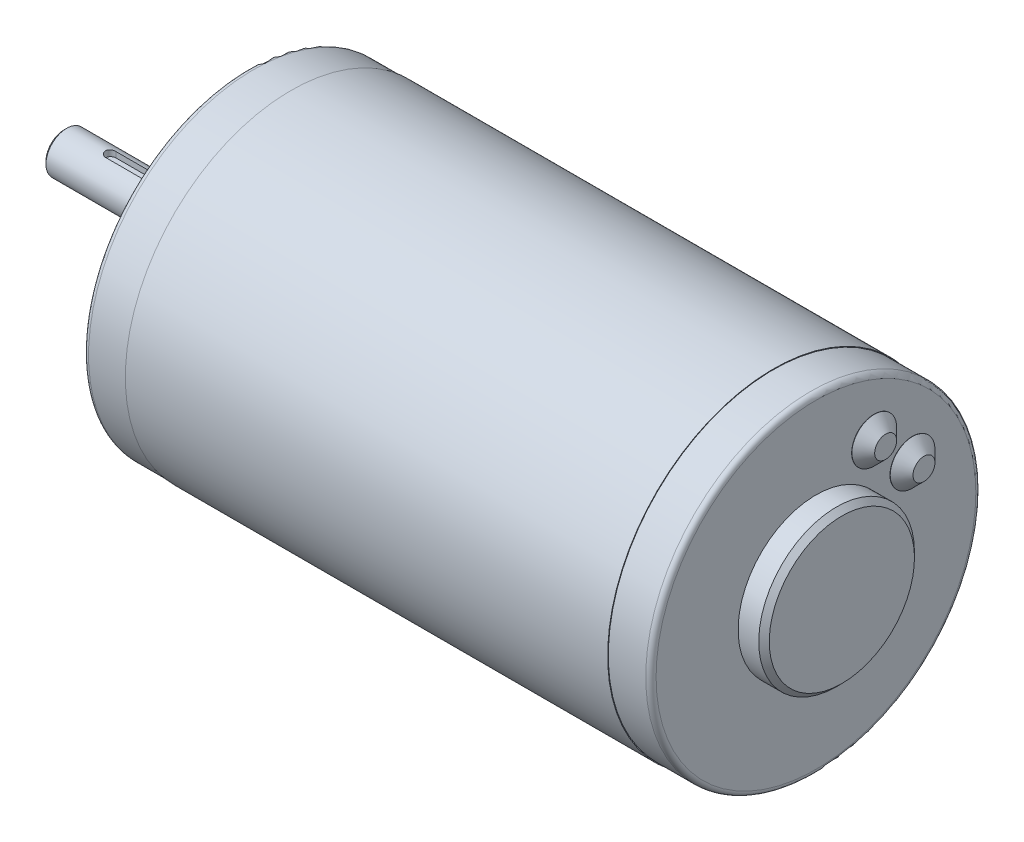
ISO-10303-21;
HEADER;
FILE_DESCRIPTION(('STEP AP214'),'2;1');
FILE_NAME('part.step','',(''),(''),'','','');
FILE_SCHEMA(('AUTOMOTIVE_DESIGN { 1 0 10303 214 1 1 1 1 }'));
ENDSEC;
DATA;
#1=APPLICATION_CONTEXT('core data for automotive mechanical design processes');
#2=APPLICATION_PROTOCOL_DEFINITION('international standard','automotive_design',2000,#1);
#3=PRODUCT_CONTEXT('',#1,'mechanical');
#4=PRODUCT('Part','Part','',(#3));
#5=PRODUCT_RELATED_PRODUCT_CATEGORY('part','',(#4));
#6=PRODUCT_DEFINITION_FORMATION('','',#4);
#7=PRODUCT_DEFINITION_CONTEXT('part definition',#1,'design');
#8=PRODUCT_DEFINITION('design','',#6,#7);
#9=PRODUCT_DEFINITION_SHAPE('','',#8);
#10=(LENGTH_UNIT() NAMED_UNIT(*) SI_UNIT(.MILLI.,.METRE.));
#11=(NAMED_UNIT(*) PLANE_ANGLE_UNIT() SI_UNIT($,.RADIAN.));
#12=(NAMED_UNIT(*) SI_UNIT($,.STERADIAN.) SOLID_ANGLE_UNIT());
#13=UNCERTAINTY_MEASURE_WITH_UNIT(LENGTH_MEASURE(1.E-05),#10,'distance_accuracy_value','');
#14=(GEOMETRIC_REPRESENTATION_CONTEXT(3) GLOBAL_UNCERTAINTY_ASSIGNED_CONTEXT((#13)) GLOBAL_UNIT_ASSIGNED_CONTEXT((#10,
#11,#12)) REPRESENTATION_CONTEXT('',''));
#15=CARTESIAN_POINT('',(0.,0.,0.));
#16=DIRECTION('',(0.,0.,1.));
#17=DIRECTION('',(1.,0.,0.));
#18=AXIS2_PLACEMENT_3D('',#15,#16,#17);
#19=CARTESIAN_POINT('',(-27.6,2.79999999999999,-1.));
#20=DIRECTION('',(0.,-1.,0.));
#21=DIRECTION('',(0.,0.,-1.));
#22=AXIS2_PLACEMENT_3D('',#19,#20,#21);
#23=PLANE('',#22);
#24=CARTESIAN_POINT('',(-7.1,2.79999999999999,0.));
#25=DIRECTION('',(0.,1.,0.));
#26=DIRECTION('',(0.,0.,1.));
#27=AXIS2_PLACEMENT_3D('',#24,#25,#26);
#28=CIRCLE('',#27,1.);
#29=CARTESIAN_POINT('',(-7.1,2.79999999999999,1.));
#30=VERTEX_POINT('',#29);
#31=CARTESIAN_POINT('',(-7.1,2.79999999999999,-1.));
#32=VERTEX_POINT('',#31);
#33=EDGE_CURVE('E88',#30,#32,#28,.T.);
#34=ORIENTED_EDGE('',*,*,#33,.T.);
#35=DIRECTION('',(1.,0.,0.));
#36=VECTOR('',#35,1.);
#37=CARTESIAN_POINT('',(-27.6,2.79999999999999,-1.));
#38=LINE('',#37,#36);
#39=CARTESIAN_POINT('',(-26.6,2.79999999999999,-1.));
#40=VERTEX_POINT('',#39);
#41=EDGE_CURVE('E83',#40,#32,#38,.T.);
#42=ORIENTED_EDGE('',*,*,#41,.F.);
#43=CARTESIAN_POINT('',(-26.6,2.79999999999999,0.));
#44=DIRECTION('',(0.,-1.,0.));
#45=DIRECTION('',(0.,0.,-1.));
#46=AXIS2_PLACEMENT_3D('',#43,#44,#45);
#47=CIRCLE('',#46,1.);
#48=CARTESIAN_POINT('',(-26.6,2.79999999999999,1.));
#49=VERTEX_POINT('',#48);
#50=EDGE_CURVE('E85',#40,#49,#47,.F.);
#51=ORIENTED_EDGE('',*,*,#50,.T.);
#52=DIRECTION('',(1.,0.,0.));
#53=VECTOR('',#52,1.);
#54=CARTESIAN_POINT('',(-27.6,2.79999999999999,1.));
#55=LINE('',#54,#53);
#56=EDGE_CURVE('E111',#49,#30,#55,.T.);
#57=ORIENTED_EDGE('',*,*,#56,.T.);
#58=EDGE_LOOP('',(#34,#42,#51,#57));
#59=FACE_BOUND('',#58,.T.);
#60=ADVANCED_FACE('F25',(#59),#23,.F.);
#61=CARTESIAN_POINT('',(-35.6,0.,0.));
#62=DIRECTION('',(-1.,0.,0.));
#63=DIRECTION('',(0.,0.,1.));
#64=AXIS2_PLACEMENT_3D('',#61,#62,#63);
#65=PLANE('',#64);
#66=CARTESIAN_POINT('',(-35.6000000000449,0.,0.));
#67=DIRECTION('',(1.,0.,0.));
#68=DIRECTION('',(0.,0.,-1.));
#69=AXIS2_PLACEMENT_3D('',#66,#67,#68);
#70=CIRCLE('',#69,3.49999999997408);
#71=CARTESIAN_POINT('',(-35.6000000000449,0.,-3.49999999997408));
#72=VERTEX_POINT('',#71);
#73=EDGE_CURVE('E333',#72,#72,#70,.T.);
#74=ORIENTED_EDGE('',*,*,#73,.F.);
#75=EDGE_LOOP('',(#74));
#76=FACE_BOUND('',#75,.T.);
#77=ADVANCED_FACE('F671',(#76),#65,.T.);
#78=CARTESIAN_POINT('',(-26.6,3.87298334620741,0.));
#79=DIRECTION('',(0.,-1.,0.));
#80=DIRECTION('',(0.,0.,-1.));
#81=AXIS2_PLACEMENT_3D('',#78,#79,#80);
#82=CYLINDRICAL_SURFACE('',#81,1.);
#83=CARTESIAN_POINT('',(-26.6,3.87298334620741,1.));
#84=CARTESIAN_POINT('',(-26.6276629851065,3.87298148580177,1.00000033749611));
#85=CARTESIAN_POINT('',(-26.6553122630182,3.8732800994947,0.998851407375366));
#86=CARTESIAN_POINT('',(-26.7104040353036,3.87445904774558,0.994271295395754));
#87=CARTESIAN_POINT('',(-26.7378465636871,3.87533928441687,0.99084049757268));
#88=CARTESIAN_POINT('',(-26.8194531732088,3.87881710972053,0.977175239382527));
#89=CARTESIAN_POINT('',(-26.8730564684822,3.88225203148808,0.963567695172493));
#90=CARTESIAN_POINT('',(-26.977124673782,3.89095422588002,0.927798076247996));
#91=CARTESIAN_POINT('',(-27.0275898782129,3.89622132630929,0.905636805423835));
#92=CARTESIAN_POINT('',(-27.1241114486473,3.90799134471939,0.853415378025865));
#93=CARTESIAN_POINT('',(-27.170166627891,3.91449459395647,0.823353103356933));
#94=CARTESIAN_POINT('',(-27.2575438819061,3.92816262398025,0.755484471828068));
#95=CARTESIAN_POINT('',(-27.2987548862455,3.93533791028915,0.717537268783974));
#96=CARTESIAN_POINT('',(-27.3743020894827,3.94945104396193,0.635275780516228));
#97=CARTESIAN_POINT('',(-27.4086371894679,3.95638885322537,0.590960479478829));
#98=CARTESIAN_POINT('',(-27.4699110016186,3.96936182283248,0.496456899401689));
#99=CARTESIAN_POINT('',(-27.496739895984,3.9753830468173,0.446195340334472));
#100=CARTESIAN_POINT('',(-27.5415247341967,3.98572346250588,0.341702590842916));
#101=CARTESIAN_POINT('',(-27.5594824242998,3.990042989147,0.287472184083007));
#102=CARTESIAN_POINT('',(-27.5856589927774,3.99641900005128,0.177744108525158));
#103=CARTESIAN_POINT('',(-27.5940676724228,3.998519529013,0.122294322002856));
#104=CARTESIAN_POINT('',(-27.6015033715433,4.00037438150815,0.0107327756816783));
#105=CARTESIAN_POINT('',(-27.6005315701923,4.00012899993444,-0.0453789000287066));
#106=CARTESIAN_POINT('',(-27.5893700363145,3.99735237365735,-0.155352492972097));
#107=CARTESIAN_POINT('',(-27.5793853834005,3.9948719867736,-0.209236701739855));
#108=CARTESIAN_POINT('',(-27.5508113208172,3.98796330636495,-0.31453871108434));
#109=CARTESIAN_POINT('',(-27.5322215304314,3.98353492665556,-0.365956402423988));
#110=CARTESIAN_POINT('',(-27.4867987193293,3.97314997761798,-0.46540728602454));
#111=CARTESIAN_POINT('',(-27.4598926057672,3.96717993827555,-0.513405629602248));
#112=CARTESIAN_POINT('',(-27.3986568701665,3.95435945541919,-0.604276631230015));
#113=CARTESIAN_POINT('',(-27.3643261297468,3.94750887933198,-0.64714851556229));
#114=CARTESIAN_POINT('',(-27.2881210879187,3.93345566022865,-0.727769389708492));
#115=CARTESIAN_POINT('',(-27.2460683634602,3.92624850477685,-0.765349103054128));
#116=CARTESIAN_POINT('',(-27.1561701330723,3.91246168284006,-0.832969575186237));
#117=CARTESIAN_POINT('',(-27.1083230467164,3.90588218842993,-0.863008270245062));
#118=CARTESIAN_POINT('',(-27.0078544021762,3.89407813586325,-0.914804709285962));
#119=CARTESIAN_POINT('',(-26.9552085351039,3.88886106009136,-0.936517017887269));
#120=CARTESIAN_POINT('',(-26.8468830715817,3.88047058807055,-0.970702351849828));
#121=CARTESIAN_POINT('',(-26.7912081448502,3.87729413761435,-0.983189189212132));
#122=CARTESIAN_POINT('',(-26.7125426192411,3.87455290681524,-0.993904635150938));
#123=CARTESIAN_POINT('',(-26.6900802967868,3.87396523110859,-0.996190790966708));
#124=CARTESIAN_POINT('',(-26.6450822100907,3.87318062488974,-0.999236757697394));
#125=CARTESIAN_POINT('',(-26.6225466240447,3.87298306219461,-0.999999038096045));
#126=CARTESIAN_POINT('',(-26.6,3.87298334620741,-1.));
#127=B_SPLINE_CURVE_WITH_KNOTS('',3,(#83,#84,#85,#86,#87,#88,#89,#90,#91,#92,#93,#94,#95,#96,
#97,#98,#99,#100,#101,#102,#103,#104,#105,#106,#107,#108,#109,#110,#111,#112,#113,#114,#115,
#116,#117,#118,#119,#120,#121,#122,#123,#124,#125,#126),.UNSPECIFIED.,.F.,.F.,(4,2,2,2,2,2,2,2,
2,2,2,2,2,2,2,2,2,2,2,2,2,4),(0.,0.0829365303397693,0.16585910608465,0.331229963080318,
0.496585282091499,0.661984974726751,0.830641897427977,0.999325753539196,1.17036187098235,
1.34136430732425,1.50890481515325,1.67642426256639,1.84022545479276,2.00403389475838,
2.16932509450376,2.33464120964329,2.50441429534542,2.67423379180967,2.84496720161068,
3.01544447539986,3.08315848722648,3.15076267731671),.UNSPECIFIED.);
#128=CARTESIAN_POINT('',(-26.6,3.87298334620741,1.));
#129=VERTEX_POINT('',#128);
#130=CARTESIAN_POINT('',(-26.6,3.87298334620741,-1.));
#131=VERTEX_POINT('',#130);
#132=EDGE_CURVE('E169',#129,#131,#127,.T.);
#133=ORIENTED_EDGE('',*,*,#132,.F.);
#134=DIRECTION('',(0.,1.,0.));
#135=VECTOR('',#134,1.);
#136=CARTESIAN_POINT('',(-26.6,2.79999999999999,1.));
#137=LINE('',#136,#135);
#138=EDGE_CURVE('E98',#129,#49,#137,.F.);
#139=ORIENTED_EDGE('',*,*,#138,.T.);
#140=ORIENTED_EDGE('',*,*,#50,.F.);
#141=DIRECTION('',(0.,1.,0.));
#142=VECTOR('',#141,1.);
#143=CARTESIAN_POINT('',(-26.6,2.79999999999999,-1.));
#144=LINE('',#143,#142);
#145=EDGE_CURVE('E92',#131,#40,#144,.F.);
#146=ORIENTED_EDGE('',*,*,#145,.F.);
#147=EDGE_LOOP('',(#133,#139,#140,#146));
#148=FACE_BOUND('',#147,.T.);
#149=ADVANCED_FACE('F95',(#148),#82,.F.);
#150=CARTESIAN_POINT('',(-27.6,2.79999999999999,-1.));
#151=DIRECTION('',(0.,0.,1.));
#152=DIRECTION('',(1.,0.,0.));
#153=AXIS2_PLACEMENT_3D('',#150,#151,#152);
#154=PLANE('',#153);
#155=DIRECTION('',(1.,0.,0.));
#156=VECTOR('',#155,1.);
#157=CARTESIAN_POINT('',(0.,3.87298334620741,-1.));
#158=LINE('',#157,#156);
#159=CARTESIAN_POINT('',(-7.1,3.87298334620741,-1.));
#160=VERTEX_POINT('',#159);
#161=EDGE_CURVE('E103',#131,#160,#158,.T.);
#162=ORIENTED_EDGE('',*,*,#161,.F.);
#163=ORIENTED_EDGE('',*,*,#145,.T.);
#164=ORIENTED_EDGE('',*,*,#41,.T.);
#165=DIRECTION('',(0.,1.,0.));
#166=VECTOR('',#165,1.);
#167=CARTESIAN_POINT('',(-7.1,2.79999999999999,-1.));
#168=LINE('',#167,#166);
#169=EDGE_CURVE('E106',#32,#160,#168,.T.);
#170=ORIENTED_EDGE('',*,*,#169,.T.);
#171=EDGE_LOOP('',(#162,#163,#164,#170));
#172=FACE_BOUND('',#171,.T.);
#173=ADVANCED_FACE('F101',(#172),#154,.T.);
#174=CARTESIAN_POINT('',(-7.1,2.79999999999999,0.));
#175=DIRECTION('',(0.,1.,0.));
#176=DIRECTION('',(0.,0.,1.));
#177=AXIS2_PLACEMENT_3D('',#174,#175,#176);
#178=CYLINDRICAL_SURFACE('',#177,1.);
#179=ORIENTED_EDGE('',*,*,#33,.F.);
#180=DIRECTION('',(0.,1.,0.));
#181=VECTOR('',#180,1.);
#182=CARTESIAN_POINT('',(-7.1,2.79999999999999,1.));
#183=LINE('',#182,#181);
#184=CARTESIAN_POINT('',(-7.1,3.87298334620741,1.));
#185=VERTEX_POINT('',#184);
#186=EDGE_CURVE('E112',#30,#185,#183,.T.);
#187=ORIENTED_EDGE('',*,*,#186,.T.);
#188=CARTESIAN_POINT('',(-7.1,3.87298334620741,-1.));
#189=CARTESIAN_POINT('',(-7.07233701489346,3.87298148580177,-1.00000033749611));
#190=CARTESIAN_POINT('',(-7.04468773698177,3.8732800994947,-0.998851407375366));
#191=CARTESIAN_POINT('',(-6.98959596469644,3.87445904774558,-0.994271295395754));
#192=CARTESIAN_POINT('',(-6.96215343631291,3.87533928441687,-0.990840497572679));
#193=CARTESIAN_POINT('',(-6.88054682679116,3.87881710972053,-0.977175239382527));
#194=CARTESIAN_POINT('',(-6.82694353151779,3.88225203148808,-0.963567695172494));
#195=CARTESIAN_POINT('',(-6.72287532621804,3.89095422588002,-0.927798076247997));
#196=CARTESIAN_POINT('',(-6.67241012178715,3.89622132630929,-0.905636805423836));
#197=CARTESIAN_POINT('',(-6.57588855135267,3.90799134471939,-0.853415378025865));
#198=CARTESIAN_POINT('',(-6.52983337210904,3.91449459395647,-0.823353103356933));
#199=CARTESIAN_POINT('',(-6.4424561180939,3.92816262398025,-0.755484471828069));
#200=CARTESIAN_POINT('',(-6.40124511375448,3.93533791028915,-0.717537268783976));
#201=CARTESIAN_POINT('',(-6.3256979105173,3.94945104396193,-0.63527578051623));
#202=CARTESIAN_POINT('',(-6.29136281053206,3.95638885322537,-0.590960479478831));
#203=CARTESIAN_POINT('',(-6.23008899838136,3.96936182283248,-0.496456899401691));
#204=CARTESIAN_POINT('',(-6.20326010401603,3.9753830468173,-0.446195340334474));
#205=CARTESIAN_POINT('',(-6.1584752658033,3.98572346250588,-0.341702590842919));
#206=CARTESIAN_POINT('',(-6.14051757570017,3.990042989147,-0.28747218408301));
#207=CARTESIAN_POINT('',(-6.11434100722257,3.99641900005128,-0.17774410852516));
#208=CARTESIAN_POINT('',(-6.10593232757718,3.998519529013,-0.122294322002858));
#209=CARTESIAN_POINT('',(-6.09849662845671,4.00037438150815,-0.0107327756816796));
#210=CARTESIAN_POINT('',(-6.09946842980766,4.00012899993444,0.0453789000287056));
#211=CARTESIAN_POINT('',(-6.11062996368545,3.99735237365735,0.155352492972096));
#212=CARTESIAN_POINT('',(-6.12061461659948,3.9948719867736,0.209236701739855));
#213=CARTESIAN_POINT('',(-6.14918867918275,3.98796330636495,0.31453871108434));
#214=CARTESIAN_POINT('',(-6.16777846956858,3.98353492665556,0.365956402423988));
#215=CARTESIAN_POINT('',(-6.21320128067065,3.97314997761798,0.465407286024539));
#216=CARTESIAN_POINT('',(-6.24010739423284,3.96717993827555,0.513405629602249));
#217=CARTESIAN_POINT('',(-6.30134312983347,3.95435945541919,0.604276631230014));
#218=CARTESIAN_POINT('',(-6.33567387025322,3.94750887933198,0.647148515562289));
#219=CARTESIAN_POINT('',(-6.41187891208131,3.93345566022865,0.72776938970849));
#220=CARTESIAN_POINT('',(-6.45393163653982,3.92624850477685,0.765349103054127));
#221=CARTESIAN_POINT('',(-6.54382986692774,3.91246168284006,0.832969575186237));
#222=CARTESIAN_POINT('',(-6.59167695328356,3.90588218842993,0.863008270245062));
#223=CARTESIAN_POINT('',(-6.69214559782377,3.89407813586325,0.914804709285962));
#224=CARTESIAN_POINT('',(-6.74479146489609,3.88886106009136,0.936517017887269));
#225=CARTESIAN_POINT('',(-6.85311692841829,3.88047058807055,0.970702351849828));
#226=CARTESIAN_POINT('',(-6.90879185514984,3.87729413761435,0.983189189212131));
#227=CARTESIAN_POINT('',(-6.98745738075891,3.87455290681524,0.993904635150938));
#228=CARTESIAN_POINT('',(-7.00991970321318,3.87396523110859,0.996190790966708));
#229=CARTESIAN_POINT('',(-7.05491778990932,3.87318062488974,0.999236757697394));
#230=CARTESIAN_POINT('',(-7.07745337595529,3.8729830621946,0.999999038096045));
#231=CARTESIAN_POINT('',(-7.1,3.87298334620741,1.));
#232=B_SPLINE_CURVE_WITH_KNOTS('',3,(#188,#189,#190,#191,#192,#193,#194,#195,#196,#197,#198,
#199,#200,#201,#202,#203,#204,#205,#206,#207,#208,#209,#210,#211,#212,#213,#214,#215,#216,#217,
#218,#219,#220,#221,#222,#223,#224,#225,#226,#227,#228,#229,#230,#231),.UNSPECIFIED.,.F.,.F.,(4,
2,2,2,2,2,2,2,2,2,2,2,2,2,2,2,2,2,2,2,2,4),(0.,0.0829365303397684,0.165859106084651,
0.331229963080317,0.496585282091498,0.661984974726749,0.830641897427974,0.999325753539193,
1.17036187098235,1.34136430732424,1.50890481515325,1.67642426256639,1.84022545479276,
2.00403389475838,2.16932509450376,2.33464120964329,2.50441429534542,2.67423379180967,
2.84496720161068,3.01544447539986,3.08315848722648,3.15076267731671),.UNSPECIFIED.);
#233=EDGE_CURVE('E160',#160,#185,#232,.T.);
#234=ORIENTED_EDGE('',*,*,#233,.F.);
#235=ORIENTED_EDGE('',*,*,#169,.F.);
#236=EDGE_LOOP('',(#179,#187,#234,#235));
#237=FACE_BOUND('',#236,.T.);
#238=ADVANCED_FACE('F175',(#237),#178,.F.);
#239=CARTESIAN_POINT('',(-27.6,2.79999999999999,1.));
#240=DIRECTION('',(0.,0.,1.));
#241=DIRECTION('',(1.,0.,0.));
#242=AXIS2_PLACEMENT_3D('',#239,#240,#241);
#243=PLANE('',#242);
#244=ORIENTED_EDGE('',*,*,#186,.F.);
#245=ORIENTED_EDGE('',*,*,#56,.F.);
#246=ORIENTED_EDGE('',*,*,#138,.F.);
#247=DIRECTION('',(1.,0.,0.));
#248=VECTOR('',#247,1.);
#249=CARTESIAN_POINT('',(0.,3.87298334620741,1.));
#250=LINE('',#249,#248);
#251=EDGE_CURVE('E168',#185,#129,#250,.F.);
#252=ORIENTED_EDGE('',*,*,#251,.F.);
#253=EDGE_LOOP('',(#244,#245,#246,#252));
#254=FACE_BOUND('',#253,.T.);
#255=ADVANCED_FACE('F190',(#254),#243,.F.);
#256=CARTESIAN_POINT('',(-35.0999999999999,0.,0.));
#257=DIRECTION('',(1.,0.,0.));
#258=DIRECTION('',(0.,0.,-1.));
#259=AXIS2_PLACEMENT_3D('',#256,#257,#258);
#260=CONICAL_SURFACE('',#259,3.99999999996226,0.785398163340605);
#261=ORIENTED_EDGE('',*,*,#73,.T.);
#262=EDGE_LOOP('',(#261));
#263=FACE_BOUND('',#262,.T.);
#264=CARTESIAN_POINT('',(-35.1,0.,0.));
#265=DIRECTION('',(1.,0.,0.));
#266=DIRECTION('',(0.,0.,-1.));
#267=AXIS2_PLACEMENT_3D('',#264,#265,#266);
#268=CIRCLE('',#267,4.);
#269=CARTESIAN_POINT('',(-35.1,0.,-4.));
#270=VERTEX_POINT('',#269);
#271=EDGE_CURVE('E159',#270,#270,#268,.T.);
#272=ORIENTED_EDGE('',*,*,#271,.F.);
#273=EDGE_LOOP('',(#272));
#274=FACE_BOUND('',#273,.T.);
#275=ADVANCED_FACE('F185',(#263,#274),#260,.T.);
#276=CARTESIAN_POINT('',(0.,0.,0.));
#277=DIRECTION('',(1.,0.,0.));
#278=DIRECTION('',(0.,0.,-1.));
#279=AXIS2_PLACEMENT_3D('',#276,#277,#278);
#280=CYLINDRICAL_SURFACE('',#279,4.);
#281=ORIENTED_EDGE('',*,*,#271,.T.);
#282=EDGE_LOOP('',(#281));
#283=FACE_BOUND('',#282,.T.);
#284=CARTESIAN_POINT('',(-4.,0.,0.));
#285=DIRECTION('',(1.,0.,0.));
#286=DIRECTION('',(0.,0.,-1.));
#287=AXIS2_PLACEMENT_3D('',#284,#285,#286);
#288=CIRCLE('',#287,4.);
#289=CARTESIAN_POINT('',(-4.,0.,-4.));
#290=VERTEX_POINT('',#289);
#291=EDGE_CURVE('E156',#290,#290,#288,.T.);
#292=ORIENTED_EDGE('',*,*,#291,.F.);
#293=EDGE_LOOP('',(#292));
#294=FACE_BOUND('',#293,.T.);
#295=ORIENTED_EDGE('',*,*,#233,.T.);
#296=ORIENTED_EDGE('',*,*,#251,.T.);
#297=ORIENTED_EDGE('',*,*,#132,.T.);
#298=ORIENTED_EDGE('',*,*,#161,.T.);
#299=EDGE_LOOP('',(#295,#296,#297,#298));
#300=FACE_BOUND('',#299,.T.);
#301=ADVANCED_FACE('F179',(#283,#294,#300),#280,.T.);
#302=CARTESIAN_POINT('',(-4.,4.,0.));
#303=DIRECTION('',(-1.,0.,0.));
#304=DIRECTION('',(0.,0.,1.));
#305=AXIS2_PLACEMENT_3D('',#302,#303,#304);
#306=PLANE('',#305);
#307=ORIENTED_EDGE('',*,*,#291,.T.);
#308=EDGE_LOOP('',(#307));
#309=FACE_BOUND('',#308,.T.);
#310=CARTESIAN_POINT('',(-4.,0.,0.));
#311=DIRECTION('',(1.,0.,0.));
#312=DIRECTION('',(0.,1.,0.));
#313=AXIS2_PLACEMENT_3D('',#310,#311,#312);
#314=CIRCLE('',#313,8.509);
#315=CARTESIAN_POINT('',(-4.,8.509,0.));
#316=VERTEX_POINT('',#315);
#317=EDGE_CURVE('E153',#316,#316,#314,.T.);
#318=ORIENTED_EDGE('',*,*,#317,.F.);
#319=EDGE_LOOP('',(#318));
#320=FACE_BOUND('',#319,.T.);
#321=ADVANCED_FACE('F184',(#309,#320),#306,.T.);
#322=CARTESIAN_POINT('',(111.8479,18.6070906828553,-11.2073596390943));
#323=DIRECTION('',(1.,0.,0.));
#324=DIRECTION('',(0.,0.,-1.));
#325=AXIS2_PLACEMENT_3D('',#322,#323,#324);
#326=PLANE('',#325);
#327=CARTESIAN_POINT('',(111.84789999993,18.6070906828553,-11.2073596390943));
#328=DIRECTION('',(-1.,0.,0.));
#329=DIRECTION('',(0.,-1.,0.));
#330=AXIS2_PLACEMENT_3D('',#327,#328,#329);
#331=CIRCLE('',#330,2.11800000003146);
#332=CARTESIAN_POINT('',(111.84789999993,16.4890906828238,-11.2073596390943));
#333=VERTEX_POINT('',#332);
#334=EDGE_CURVE('E150',#333,#333,#331,.T.);
#335=ORIENTED_EDGE('',*,*,#334,.F.);
#336=EDGE_LOOP('',(#335));
#337=FACE_BOUND('',#336,.T.);
#338=ADVANCED_FACE('F474',(#337),#326,.T.);
#339=CARTESIAN_POINT('',(114.6,15.0368,0.));
#340=DIRECTION('',(1.,0.,0.));
#341=DIRECTION('',(0.,0.,-1.));
#342=AXIS2_PLACEMENT_3D('',#339,#340,#341);
#343=PLANE('',#342);
#344=CARTESIAN_POINT('',(114.6,0.,0.));
#345=DIRECTION('',(-1.,0.,0.));
#346=DIRECTION('',(0.,-1.,0.));
#347=AXIS2_PLACEMENT_3D('',#344,#345,#346);
#348=CIRCLE('',#347,14.0208);
#349=CARTESIAN_POINT('',(114.6,-14.0208,0.));
#350=VERTEX_POINT('',#349);
#351=EDGE_CURVE('E147',#350,#350,#348,.T.);
#352=ORIENTED_EDGE('',*,*,#351,.F.);
#353=EDGE_LOOP('',(#352));
#354=FACE_BOUND('',#353,.T.);
#355=ADVANCED_FACE('F464',(#354),#343,.T.);
#356=CARTESIAN_POINT('',(111.8479,11.2073596390943,-18.6070906828553));
#357=DIRECTION('',(1.,0.,0.));
#358=DIRECTION('',(0.,0.,-1.));
#359=AXIS2_PLACEMENT_3D('',#356,#357,#358);
#360=PLANE('',#359);
#361=CARTESIAN_POINT('',(111.84789999993,11.2073596390943,-18.6070906828553));
#362=DIRECTION('',(-1.,0.,0.));
#363=DIRECTION('',(0.,0.,1.));
#364=AXIS2_PLACEMENT_3D('',#361,#362,#363);
#365=CIRCLE('',#364,2.1180000000021);
#366=CARTESIAN_POINT('',(111.84789999993,11.2073596390943,-16.4890906828532));
#367=VERTEX_POINT('',#366);
#368=EDGE_CURVE('E143',#367,#367,#365,.T.);
#369=ORIENTED_EDGE('',*,*,#368,.F.);
#370=EDGE_LOOP('',(#369));
#371=FACE_BOUND('',#370,.T.);
#372=ADVANCED_FACE('F457',(#371),#360,.T.);
#373=CARTESIAN_POINT('',(13.6143999999945,25.4,0.));
#374=DIRECTION('',(-1.,0.,0.));
#375=DIRECTION('',(0.,0.,1.));
#376=AXIS2_PLACEMENT_3D('',#373,#374,#375);
#377=CONICAL_SURFACE('',#376,2.01929999997219,1.02974425867198);
#378=CARTESIAN_POINT('',(14.827717847993,25.4,0.));
#379=VERTEX_POINT('',#378);
#380=VERTEX_LOOP('',#379);
#381=FACE_BOUND('',#380,.T.);
#382=CARTESIAN_POINT('',(13.6144,25.4,0.));
#383=DIRECTION('',(-1.,0.,0.));
#384=DIRECTION('',(0.,0.,1.));
#385=AXIS2_PLACEMENT_3D('',#382,#383,#384);
#386=CIRCLE('',#385,2.0193);
#387=CARTESIAN_POINT('',(13.6144,25.4,2.0193));
#388=VERTEX_POINT('',#387);
#389=EDGE_CURVE('E146',#388,#388,#386,.T.);
#390=ORIENTED_EDGE('',*,*,#389,.T.);
#391=EDGE_LOOP('',(#390));
#392=FACE_BOUND('',#391,.T.);
#393=ADVANCED_FACE('F463',(#381,#392),#377,.F.);
#394=CARTESIAN_POINT('',(13.6143999999945,-25.4,0.));
#395=DIRECTION('',(-1.,0.,0.));
#396=DIRECTION('',(0.,0.,1.));
#397=AXIS2_PLACEMENT_3D('',#394,#395,#396);
#398=CONICAL_SURFACE('',#397,2.01929999997219,1.02974425867198);
#399=CARTESIAN_POINT('',(14.827717847993,-25.4,0.));
#400=VERTEX_POINT('',#399);
#401=VERTEX_LOOP('',#400);
#402=FACE_BOUND('',#401,.T.);
#403=CARTESIAN_POINT('',(13.6144,-25.4,0.));
#404=DIRECTION('',(-1.,0.,0.));
#405=DIRECTION('',(0.,0.,1.));
#406=AXIS2_PLACEMENT_3D('',#403,#404,#405);
#407=CIRCLE('',#406,2.0193);
#408=CARTESIAN_POINT('',(13.6144,-25.4,2.0193));
#409=VERTEX_POINT('',#408);
#410=EDGE_CURVE('E323',#409,#409,#407,.T.);
#411=ORIENTED_EDGE('',*,*,#410,.T.);
#412=EDGE_LOOP('',(#411));
#413=FACE_BOUND('',#412,.T.);
#414=ADVANCED_FACE('F524',(#402,#413),#398,.F.);
#415=CARTESIAN_POINT('',(-2.984,0.,0.));
#416=DIRECTION('',(1.,0.,0.));
#417=DIRECTION('',(0.,1.,0.));
#418=AXIS2_PLACEMENT_3D('',#415,#416,#417);
#419=CONICAL_SURFACE('',#418,9.525,0.78539816339745);
#420=ORIENTED_EDGE('',*,*,#317,.T.);
#421=EDGE_LOOP('',(#420));
#422=FACE_BOUND('',#421,.T.);
#423=CARTESIAN_POINT('',(-2.984,0.,0.));
#424=DIRECTION('',(1.,0.,0.));
#425=DIRECTION('',(0.,0.,-1.));
#426=AXIS2_PLACEMENT_3D('',#423,#424,#425);
#427=CIRCLE('',#426,9.525);
#428=CARTESIAN_POINT('',(-2.984,0.,-9.525));
#429=VERTEX_POINT('',#428);
#430=EDGE_CURVE('E320',#429,#429,#427,.T.);
#431=ORIENTED_EDGE('',*,*,#430,.F.);
#432=EDGE_LOOP('',(#431));
#433=FACE_BOUND('',#432,.T.);
#434=ADVANCED_FACE('F449',(#422,#433),#419,.T.);
#435=CARTESIAN_POINT('',(109.647900000027,18.6070906828553,-11.2073596390943));
#436=DIRECTION('',(-1.,0.,0.));
#437=DIRECTION('',(0.,-1.,0.));
#438=AXIS2_PLACEMENT_3D('',#435,#436,#437);
#439=CONICAL_SURFACE('',#438,4.31799999987712,0.785398163384529);
#440=CARTESIAN_POINT('',(109.6479,18.6070906828553,-11.2073596390943));
#441=DIRECTION('',(-1.,0.,0.));
#442=DIRECTION('',(0.,0.,1.));
#443=AXIS2_PLACEMENT_3D('',#440,#441,#442);
#444=CIRCLE('',#443,4.318);
#445=CARTESIAN_POINT('',(109.6479,18.6070906828553,-6.88935963909434));
#446=VERTEX_POINT('',#445);
#447=EDGE_CURVE('E317',#446,#446,#444,.T.);
#448=ORIENTED_EDGE('',*,*,#447,.F.);
#449=EDGE_LOOP('',(#448));
#450=FACE_BOUND('',#449,.T.);
#451=ORIENTED_EDGE('',*,*,#334,.T.);
#452=EDGE_LOOP('',(#451));
#453=FACE_BOUND('',#452,.T.);
#454=ADVANCED_FACE('F443',(#450,#453),#439,.T.);
#455=CARTESIAN_POINT('',(113.584,0.,0.));
#456=DIRECTION('',(-1.,0.,0.));
#457=DIRECTION('',(0.,-1.,0.));
#458=AXIS2_PLACEMENT_3D('',#455,#456,#457);
#459=CONICAL_SURFACE('',#458,15.0368,0.785398163397441);
#460=ORIENTED_EDGE('',*,*,#351,.T.);
#461=EDGE_LOOP('',(#460));
#462=FACE_BOUND('',#461,.T.);
#463=CARTESIAN_POINT('',(113.584,0.,0.));
#464=DIRECTION('',(1.,0.,0.));
#465=DIRECTION('',(0.,0.,-1.));
#466=AXIS2_PLACEMENT_3D('',#463,#464,#465);
#467=CIRCLE('',#466,15.0368);
#468=CARTESIAN_POINT('',(113.584,0.,-15.0368));
#469=VERTEX_POINT('',#468);
#470=EDGE_CURVE('E314',#469,#469,#467,.F.);
#471=ORIENTED_EDGE('',*,*,#470,.F.);
#472=EDGE_LOOP('',(#471));
#473=FACE_BOUND('',#472,.T.);
#474=ADVANCED_FACE('F433',(#462,#473),#459,.T.);
#475=CARTESIAN_POINT('',(109.647900000084,11.2073596390943,-18.6070906828553));
#476=DIRECTION('',(-1.,0.,0.));
#477=DIRECTION('',(0.,0.,1.));
#478=AXIS2_PLACEMENT_3D('',#475,#476,#477);
#479=CONICAL_SURFACE('',#478,4.31799999990461,0.785398163410367);
#480=CARTESIAN_POINT('',(109.6479,11.2073596390943,-18.6070906828553));
#481=DIRECTION('',(-1.,0.,0.));
#482=DIRECTION('',(0.,0.,1.));
#483=AXIS2_PLACEMENT_3D('',#480,#481,#482);
#484=CIRCLE('',#483,4.318);
#485=CARTESIAN_POINT('',(109.6479,11.2073596390943,-14.2890906828553));
#486=VERTEX_POINT('',#485);
#487=EDGE_CURVE('E142',#486,#486,#484,.T.);
#488=ORIENTED_EDGE('',*,*,#487,.F.);
#489=EDGE_LOOP('',(#488));
#490=FACE_BOUND('',#489,.T.);
#491=ORIENTED_EDGE('',*,*,#368,.T.);
#492=EDGE_LOOP('',(#491));
#493=FACE_BOUND('',#492,.T.);
#494=ADVANCED_FACE('F426',(#490,#493),#479,.T.);
#495=CARTESIAN_POINT('',(0.,25.4,0.));
#496=DIRECTION('',(-1.,0.,0.));
#497=DIRECTION('',(0.,0.,1.));
#498=AXIS2_PLACEMENT_3D('',#495,#496,#497);
#499=CYLINDRICAL_SURFACE('',#498,2.0193);
#500=CARTESIAN_POINT('',(0.,25.4,0.));
#501=DIRECTION('',(-1.,0.,0.));
#502=DIRECTION('',(0.,0.,1.));
#503=AXIS2_PLACEMENT_3D('',#500,#501,#502);
#504=CIRCLE('',#503,2.0193);
#505=CARTESIAN_POINT('',(0.,25.4,2.0193));
#506=VERTEX_POINT('',#505);
#507=EDGE_CURVE('E139',#506,#506,#504,.F.);
#508=ORIENTED_EDGE('',*,*,#507,.F.);
#509=EDGE_LOOP('',(#508));
#510=FACE_BOUND('',#509,.T.);
#511=ORIENTED_EDGE('',*,*,#389,.F.);
#512=EDGE_LOOP('',(#511));
#513=FACE_BOUND('',#512,.T.);
#514=ADVANCED_FACE('F432',(#510,#513),#499,.F.);
#515=CARTESIAN_POINT('',(0.,-25.4,0.));
#516=DIRECTION('',(-1.,0.,0.));
#517=DIRECTION('',(0.,0.,1.));
#518=AXIS2_PLACEMENT_3D('',#515,#516,#517);
#519=CYLINDRICAL_SURFACE('',#518,2.0193);
#520=CARTESIAN_POINT('',(0.,-25.4,0.));
#521=DIRECTION('',(-1.,0.,0.));
#522=DIRECTION('',(0.,0.,1.));
#523=AXIS2_PLACEMENT_3D('',#520,#521,#522);
#524=CIRCLE('',#523,2.0193);
#525=CARTESIAN_POINT('',(0.,-25.4,2.0193));
#526=VERTEX_POINT('',#525);
#527=EDGE_CURVE('E136',#526,#526,#524,.F.);
#528=ORIENTED_EDGE('',*,*,#527,.F.);
#529=EDGE_LOOP('',(#528));
#530=FACE_BOUND('',#529,.T.);
#531=ORIENTED_EDGE('',*,*,#410,.F.);
#532=EDGE_LOOP('',(#531));
#533=FACE_BOUND('',#532,.T.);
#534=ADVANCED_FACE('F549',(#530,#533),#519,.F.);
#535=CARTESIAN_POINT('',(0.,0.,0.));
#536=DIRECTION('',(1.,0.,0.));
#537=DIRECTION('',(0.,0.,-1.));
#538=AXIS2_PLACEMENT_3D('',#535,#536,#537);
#539=CYLINDRICAL_SURFACE('',#538,9.525);
#540=ORIENTED_EDGE('',*,*,#430,.T.);
#541=EDGE_LOOP('',(#540));
#542=FACE_BOUND('',#541,.T.);
#543=CARTESIAN_POINT('',(0.,0.,0.));
#544=DIRECTION('',(1.,0.,0.));
#545=DIRECTION('',(0.,0.,-1.));
#546=AXIS2_PLACEMENT_3D('',#543,#544,#545);
#547=CIRCLE('',#546,9.525);
#548=CARTESIAN_POINT('',(0.,0.,-9.525));
#549=VERTEX_POINT('',#548);
#550=EDGE_CURVE('E133',#549,#549,#547,.T.);
#551=ORIENTED_EDGE('',*,*,#550,.F.);
#552=EDGE_LOOP('',(#551));
#553=FACE_BOUND('',#552,.T.);
#554=ADVANCED_FACE('F418',(#542,#553),#539,.T.);
#555=CARTESIAN_POINT('',(111.8479,18.6070906828553,-11.2073596390943));
#556=DIRECTION('',(-1.,0.,0.));
#557=DIRECTION('',(0.,0.,1.));
#558=AXIS2_PLACEMENT_3D('',#555,#556,#557);
#559=CYLINDRICAL_SURFACE('',#558,4.318);
#560=CARTESIAN_POINT('',(109.6,18.6070906828553,-11.2073596390943));
#561=DIRECTION('',(-1.,0.,0.));
#562=DIRECTION('',(0.,0.,1.));
#563=AXIS2_PLACEMENT_3D('',#560,#561,#562);
#564=CIRCLE('',#563,4.318);
#565=CARTESIAN_POINT('',(109.6,18.6070906828553,-6.88935963909434));
#566=VERTEX_POINT('',#565);
#567=EDGE_CURVE('E130',#566,#566,#564,.T.);
#568=ORIENTED_EDGE('',*,*,#567,.F.);
#569=EDGE_LOOP('',(#568));
#570=FACE_BOUND('',#569,.T.);
#571=ORIENTED_EDGE('',*,*,#447,.T.);
#572=EDGE_LOOP('',(#571));
#573=FACE_BOUND('',#572,.T.);
#574=ADVANCED_FACE('F412',(#570,#573),#559,.T.);
#575=CARTESIAN_POINT('',(0.,0.,0.));
#576=DIRECTION('',(1.,0.,0.));
#577=DIRECTION('',(0.,0.,-1.));
#578=AXIS2_PLACEMENT_3D('',#575,#576,#577);
#579=CYLINDRICAL_SURFACE('',#578,15.0368);
#580=CARTESIAN_POINT('',(109.6,0.,0.));
#581=DIRECTION('',(1.,0.,0.));
#582=DIRECTION('',(0.,0.,-1.));
#583=AXIS2_PLACEMENT_3D('',#580,#581,#582);
#584=CIRCLE('',#583,15.0368);
#585=CARTESIAN_POINT('',(109.6,0.,-15.0368));
#586=VERTEX_POINT('',#585);
#587=EDGE_CURVE('E127',#586,#586,#584,.F.);
#588=ORIENTED_EDGE('',*,*,#587,.F.);
#589=EDGE_LOOP('',(#588));
#590=FACE_BOUND('',#589,.T.);
#591=ORIENTED_EDGE('',*,*,#470,.T.);
#592=EDGE_LOOP('',(#591));
#593=FACE_BOUND('',#592,.T.);
#594=ADVANCED_FACE('F403',(#590,#593),#579,.T.);
#595=CARTESIAN_POINT('',(111.8479,11.2073596390943,-18.6070906828553));
#596=DIRECTION('',(-1.,0.,0.));
#597=DIRECTION('',(0.,0.,1.));
#598=AXIS2_PLACEMENT_3D('',#595,#596,#597);
#599=CYLINDRICAL_SURFACE('',#598,4.318);
#600=CARTESIAN_POINT('',(109.6,11.2073596390943,-18.6070906828553));
#601=DIRECTION('',(-1.,0.,0.));
#602=DIRECTION('',(0.,0.,1.));
#603=AXIS2_PLACEMENT_3D('',#600,#601,#602);
#604=CIRCLE('',#603,4.318);
#605=CARTESIAN_POINT('',(109.6,11.2073596390943,-14.2890906828553));
#606=VERTEX_POINT('',#605);
#607=EDGE_CURVE('E123',#606,#606,#604,.T.);
#608=ORIENTED_EDGE('',*,*,#607,.F.);
#609=EDGE_LOOP('',(#608));
#610=FACE_BOUND('',#609,.T.);
#611=ORIENTED_EDGE('',*,*,#487,.T.);
#612=EDGE_LOOP('',(#611));
#613=FACE_BOUND('',#612,.T.);
#614=ADVANCED_FACE('F397',(#610,#613),#599,.T.);
#615=CARTESIAN_POINT('',(0.,9.525,0.));
#616=DIRECTION('',(-1.,0.,0.));
#617=DIRECTION('',(0.,0.,1.));
#618=AXIS2_PLACEMENT_3D('',#615,#616,#617);
#619=PLANE('',#618);
#620=ORIENTED_EDGE('',*,*,#550,.T.);
#621=EDGE_LOOP('',(#620));
#622=FACE_BOUND('',#621,.T.);
#623=CARTESIAN_POINT('',(0.,0.,0.));
#624=DIRECTION('',(1.,0.,0.));
#625=DIRECTION('',(0.,0.,-1.));
#626=AXIS2_PLACEMENT_3D('',#623,#624,#625);
#627=CIRCLE('',#626,30.877);
#628=CARTESIAN_POINT('',(0.,0.,-30.877));
#629=VERTEX_POINT('',#628);
#630=CARTESIAN_POINT('',(0.,0.,30.877));
#631=VERTEX_POINT('',#630);
#632=EDGE_CURVE('E126',#629,#631,#627,.T.);
#633=ORIENTED_EDGE('',*,*,#632,.F.);
#634=CARTESIAN_POINT('',(0.,0.,0.));
#635=DIRECTION('',(1.,0.,0.));
#636=DIRECTION('',(0.,0.,1.));
#637=AXIS2_PLACEMENT_3D('',#634,#635,#636);
#638=CIRCLE('',#637,30.877);
#639=EDGE_CURVE('E293',#631,#629,#638,.T.);
#640=ORIENTED_EDGE('',*,*,#639,.F.);
#641=EDGE_LOOP('',(#633,#640));
#642=FACE_BOUND('',#641,.T.);
#643=ORIENTED_EDGE('',*,*,#527,.T.);
#644=EDGE_LOOP('',(#643));
#645=FACE_BOUND('',#644,.T.);
#646=ORIENTED_EDGE('',*,*,#507,.T.);
#647=EDGE_LOOP('',(#646));
#648=FACE_BOUND('',#647,.T.);
#649=ADVANCED_FACE('F259',(#622,#642,#645,#648),#619,.T.);
#650=CARTESIAN_POINT('',(109.6,31.877,0.));
#651=DIRECTION('',(1.,0.,0.));
#652=DIRECTION('',(0.,0.,-1.));
#653=AXIS2_PLACEMENT_3D('',#650,#651,#652);
#654=PLANE('',#653);
#655=ORIENTED_EDGE('',*,*,#607,.T.);
#656=EDGE_LOOP('',(#655));
#657=FACE_BOUND('',#656,.T.);
#658=ORIENTED_EDGE('',*,*,#587,.T.);
#659=EDGE_LOOP('',(#658));
#660=FACE_BOUND('',#659,.T.);
#661=CARTESIAN_POINT('',(109.6,0.,0.));
#662=DIRECTION('',(-1.,0.,0.));
#663=DIRECTION('',(0.,0.,1.));
#664=AXIS2_PLACEMENT_3D('',#661,#662,#663);
#665=CIRCLE('',#664,30.877);
#666=CARTESIAN_POINT('',(109.6,0.,30.877));
#667=VERTEX_POINT('',#666);
#668=CARTESIAN_POINT('',(109.6,0.,-30.877));
#669=VERTEX_POINT('',#668);
#670=EDGE_CURVE('E44',#667,#669,#665,.T.);
#671=ORIENTED_EDGE('',*,*,#670,.F.);
#672=CARTESIAN_POINT('',(109.6,0.,0.));
#673=DIRECTION('',(-1.,0.,0.));
#674=DIRECTION('',(0.,0.,-1.));
#675=AXIS2_PLACEMENT_3D('',#672,#673,#674);
#676=CIRCLE('',#675,30.877);
#677=EDGE_CURVE('E241',#669,#667,#676,.T.);
#678=ORIENTED_EDGE('',*,*,#677,.F.);
#679=EDGE_LOOP('',(#671,#678));
#680=FACE_BOUND('',#679,.T.);
#681=ORIENTED_EDGE('',*,*,#567,.T.);
#682=EDGE_LOOP('',(#681));
#683=FACE_BOUND('',#682,.T.);
#684=ADVANCED_FACE('F250',(#657,#660,#680,#683),#654,.T.);
#685=CARTESIAN_POINT('',(0.999999999999999,0.,0.));
#686=DIRECTION('',(-1.,0.,0.));
#687=DIRECTION('',(0.,0.,1.));
#688=AXIS2_PLACEMENT_3D('',#685,#686,#687);
#689=TOROIDAL_SURFACE('',#688,30.877,1.);
#690=CARTESIAN_POINT('',(0.999999999999999,0.,0.));
#691=DIRECTION('',(1.,0.,0.));
#692=DIRECTION('',(0.,0.,-1.));
#693=AXIS2_PLACEMENT_3D('',#690,#691,#692);
#694=CIRCLE('',#693,31.877);
#695=CARTESIAN_POINT('',(0.999999999999999,0.,-31.877));
#696=VERTEX_POINT('',#695);
#697=EDGE_CURVE('E239',#696,#696,#694,.T.);
#698=ORIENTED_EDGE('',*,*,#697,.F.);
#699=EDGE_LOOP('',(#698));
#700=FACE_BOUND('',#699,.T.);
#701=ORIENTED_EDGE('',*,*,#639,.T.);
#702=ORIENTED_EDGE('',*,*,#632,.T.);
#703=EDGE_LOOP('',(#701,#702));
#704=FACE_BOUND('',#703,.T.);
#705=ADVANCED_FACE('F228',(#700,#704),#689,.T.);
#706=CARTESIAN_POINT('',(108.6,0.,0.));
#707=DIRECTION('',(1.,0.,0.));
#708=DIRECTION('',(0.,0.,-1.));
#709=AXIS2_PLACEMENT_3D('',#706,#707,#708);
#710=TOROIDAL_SURFACE('',#709,30.877,1.);
#711=CARTESIAN_POINT('',(108.6,0.,0.));
#712=DIRECTION('',(1.,0.,0.));
#713=DIRECTION('',(0.,0.,-1.));
#714=AXIS2_PLACEMENT_3D('',#711,#712,#713);
#715=CIRCLE('',#714,31.877);
#716=CARTESIAN_POINT('',(108.6,0.,-31.877));
#717=VERTEX_POINT('',#716);
#718=EDGE_CURVE('E122',#717,#717,#715,.F.);
#719=ORIENTED_EDGE('',*,*,#718,.F.);
#720=EDGE_LOOP('',(#719));
#721=FACE_BOUND('',#720,.T.);
#722=ORIENTED_EDGE('',*,*,#677,.T.);
#723=ORIENTED_EDGE('',*,*,#670,.T.);
#724=EDGE_LOOP('',(#722,#723));
#725=FACE_BOUND('',#724,.T.);
#726=ADVANCED_FACE('F223',(#721,#725),#710,.T.);
#727=CARTESIAN_POINT('',(0.,0.,0.));
#728=DIRECTION('',(1.,0.,0.));
#729=DIRECTION('',(0.,0.,-1.));
#730=AXIS2_PLACEMENT_3D('',#727,#728,#729);
#731=CYLINDRICAL_SURFACE('',#730,31.877);
#732=ORIENTED_EDGE('',*,*,#697,.T.);
#733=EDGE_LOOP('',(#732));
#734=FACE_BOUND('',#733,.T.);
#735=CARTESIAN_POINT('',(8.2296,0.,0.));
#736=DIRECTION('',(1.,0.,0.));
#737=DIRECTION('',(0.,0.,-1.));
#738=AXIS2_PLACEMENT_3D('',#735,#736,#737);
#739=CIRCLE('',#738,31.877);
#740=CARTESIAN_POINT('',(8.2296,0.,-31.877));
#741=VERTEX_POINT('',#740);
#742=EDGE_CURVE('E119',#741,#741,#739,.T.);
#743=ORIENTED_EDGE('',*,*,#742,.F.);
#744=EDGE_LOOP('',(#743));
#745=FACE_BOUND('',#744,.T.);
#746=ADVANCED_FACE('F219',(#734,#745),#731,.T.);
#747=CARTESIAN_POINT('',(0.,0.,0.));
#748=DIRECTION('',(1.,0.,0.));
#749=DIRECTION('',(0.,0.,-1.));
#750=AXIS2_PLACEMENT_3D('',#747,#748,#749);
#751=CYLINDRICAL_SURFACE('',#750,31.877);
#752=CARTESIAN_POINT('',(101.3704,0.,0.));
#753=DIRECTION('',(1.,0.,0.));
#754=DIRECTION('',(0.,0.,-1.));
#755=AXIS2_PLACEMENT_3D('',#752,#753,#754);
#756=CIRCLE('',#755,31.877);
#757=CARTESIAN_POINT('',(101.3704,0.,-31.877));
#758=VERTEX_POINT('',#757);
#759=EDGE_CURVE('E116',#758,#758,#756,.F.);
#760=ORIENTED_EDGE('',*,*,#759,.F.);
#761=EDGE_LOOP('',(#760));
#762=FACE_BOUND('',#761,.T.);
#763=ORIENTED_EDGE('',*,*,#718,.T.);
#764=EDGE_LOOP('',(#763));
#765=FACE_BOUND('',#764,.T.);
#766=ADVANCED_FACE('F215',(#762,#765),#751,.T.);
#767=CARTESIAN_POINT('',(8.2296,31.877,0.));
#768=DIRECTION('',(-1.,0.,0.));
#769=DIRECTION('',(0.,0.,1.));
#770=AXIS2_PLACEMENT_3D('',#767,#768,#769);
#771=PLANE('',#770);
#772=CARTESIAN_POINT('',(8.2296,0.,0.));
#773=DIRECTION('',(1.,0.,0.));
#774=DIRECTION('',(0.,0.,-1.));
#775=AXIS2_PLACEMENT_3D('',#772,#773,#774);
#776=CIRCLE('',#775,32.004);
#777=CARTESIAN_POINT('',(8.2296,0.,-32.004));
#778=VERTEX_POINT('',#777);
#779=EDGE_CURVE('E36',#778,#778,#776,.T.);
#780=ORIENTED_EDGE('',*,*,#779,.F.);
#781=EDGE_LOOP('',(#780));
#782=FACE_BOUND('',#781,.T.);
#783=ORIENTED_EDGE('',*,*,#742,.T.);
#784=EDGE_LOOP('',(#783));
#785=FACE_BOUND('',#784,.T.);
#786=ADVANCED_FACE('F208',(#782,#785),#771,.T.);
#787=CARTESIAN_POINT('',(101.3704,32.004,0.));
#788=DIRECTION('',(1.,0.,0.));
#789=DIRECTION('',(0.,0.,-1.));
#790=AXIS2_PLACEMENT_3D('',#787,#788,#789);
#791=PLANE('',#790);
#792=ORIENTED_EDGE('',*,*,#759,.T.);
#793=EDGE_LOOP('',(#792));
#794=FACE_BOUND('',#793,.T.);
#795=CARTESIAN_POINT('',(101.3704,0.,0.));
#796=DIRECTION('',(1.,0.,0.));
#797=DIRECTION('',(0.,0.,-1.));
#798=AXIS2_PLACEMENT_3D('',#795,#796,#797);
#799=CIRCLE('',#798,32.004);
#800=CARTESIAN_POINT('',(101.3704,0.,-32.004));
#801=VERTEX_POINT('',#800);
#802=EDGE_CURVE('E13',#801,#801,#799,.F.);
#803=ORIENTED_EDGE('',*,*,#802,.F.);
#804=EDGE_LOOP('',(#803));
#805=FACE_BOUND('',#804,.T.);
#806=ADVANCED_FACE('F202',(#794,#805),#791,.T.);
#807=CARTESIAN_POINT('',(0.,0.,0.));
#808=DIRECTION('',(1.,0.,0.));
#809=DIRECTION('',(0.,0.,-1.));
#810=AXIS2_PLACEMENT_3D('',#807,#808,#809);
#811=CYLINDRICAL_SURFACE('',#810,32.004);
#812=ORIENTED_EDGE('',*,*,#802,.T.);
#813=EDGE_LOOP('',(#812));
#814=FACE_BOUND('',#813,.T.);
#815=ORIENTED_EDGE('',*,*,#779,.T.);
#816=EDGE_LOOP('',(#815));
#817=FACE_BOUND('',#816,.T.);
#818=ADVANCED_FACE('F200',(#814,#817),#811,.T.);
#819=CLOSED_SHELL('',(#60,#77,#149,#173,#238,#255,#275,#301,#321,#338,#355,#372,#393,#414,#434,
#454,#474,#494,#514,#534,#554,#574,#594,#614,#649,#684,#705,#726,#746,#766,#786,#806,#818));
#820=MANIFOLD_SOLID_BREP('B1',#819);
#821=ADVANCED_BREP_SHAPE_REPRESENTATION('',(#18,#820),#14);
#822=SHAPE_DEFINITION_REPRESENTATION(#9,#821);
ENDSEC;
END-ISO-10303-21;
